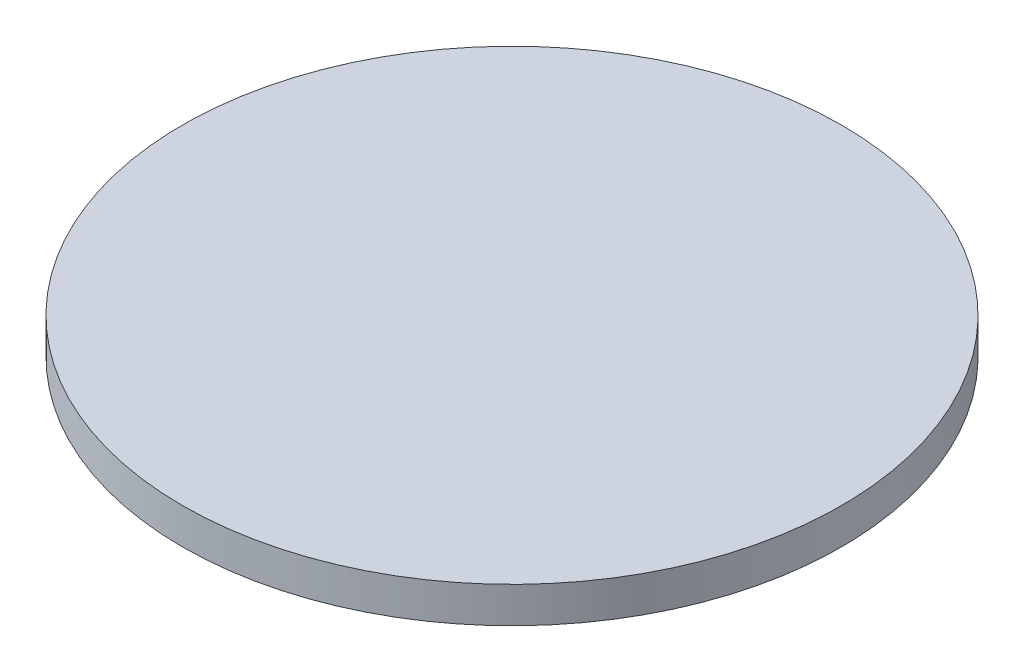
ISO-10303-21;
HEADER;
FILE_DESCRIPTION(('STEP AP214'),'2;1');
FILE_NAME('part.step','',(''),(''),'','','');
FILE_SCHEMA(('AUTOMOTIVE_DESIGN { 1 0 10303 214 1 1 1 1 }'));
ENDSEC;
DATA;
#1=APPLICATION_CONTEXT('core data for automotive mechanical design processes');
#2=APPLICATION_PROTOCOL_DEFINITION('international standard','automotive_design',2000,#1);
#3=PRODUCT_CONTEXT('',#1,'mechanical');
#4=PRODUCT('Part','Part','',(#3));
#5=PRODUCT_RELATED_PRODUCT_CATEGORY('part','',(#4));
#6=PRODUCT_DEFINITION_FORMATION('','',#4);
#7=PRODUCT_DEFINITION_CONTEXT('part definition',#1,'design');
#8=PRODUCT_DEFINITION('design','',#6,#7);
#9=PRODUCT_DEFINITION_SHAPE('','',#8);
#10=(LENGTH_UNIT() NAMED_UNIT(*) SI_UNIT(.MILLI.,.METRE.));
#11=(NAMED_UNIT(*) PLANE_ANGLE_UNIT() SI_UNIT($,.RADIAN.));
#12=(NAMED_UNIT(*) SI_UNIT($,.STERADIAN.) SOLID_ANGLE_UNIT());
#13=UNCERTAINTY_MEASURE_WITH_UNIT(LENGTH_MEASURE(1.E-05),#10,'distance_accuracy_value','');
#14=(GEOMETRIC_REPRESENTATION_CONTEXT(3) GLOBAL_UNCERTAINTY_ASSIGNED_CONTEXT((#13)) GLOBAL_UNIT_ASSIGNED_CONTEXT((#10,
#11,#12)) REPRESENTATION_CONTEXT('',''));
#15=CARTESIAN_POINT('',(0.,0.,0.));
#16=DIRECTION('',(0.,0.,1.));
#17=DIRECTION('',(1.,0.,0.));
#18=AXIS2_PLACEMENT_3D('',#15,#16,#17);
#19=CARTESIAN_POINT('',(0.,1.36,0.));
#20=DIRECTION('',(0.,-1.,0.));
#21=DIRECTION('',(0.,0.,-1.));
#22=AXIS2_PLACEMENT_3D('',#19,#20,#21);
#23=CYLINDRICAL_SURFACE('',#22,12.5);
#24=CARTESIAN_POINT('',(0.,1.36,0.));
#25=DIRECTION('',(0.,1.,0.));
#26=DIRECTION('',(0.,0.,1.));
#27=AXIS2_PLACEMENT_3D('',#24,#25,#26);
#28=CIRCLE('',#27,12.5);
#29=CARTESIAN_POINT('',(0.,1.36,12.5));
#30=VERTEX_POINT('',#29);
#31=EDGE_CURVE('E10',#30,#30,#28,.T.);
#32=ORIENTED_EDGE('',*,*,#31,.F.);
#33=EDGE_LOOP('',(#32));
#34=FACE_BOUND('',#33,.T.);
#35=CARTESIAN_POINT('',(0.,0.,0.));
#36=DIRECTION('',(0.,1.,0.));
#37=DIRECTION('',(0.,0.,1.));
#38=AXIS2_PLACEMENT_3D('',#35,#36,#37);
#39=CIRCLE('',#38,12.5);
#40=CARTESIAN_POINT('',(0.,0.,12.5));
#41=VERTEX_POINT('',#40);
#42=EDGE_CURVE('E36',#41,#41,#39,.T.);
#43=ORIENTED_EDGE('',*,*,#42,.T.);
#44=EDGE_LOOP('',(#43));
#45=FACE_BOUND('',#44,.T.);
#46=ADVANCED_FACE('F33',(#34,#45),#23,.T.);
#47=CARTESIAN_POINT('',(0.,1.36,0.));
#48=DIRECTION('',(0.,1.,0.));
#49=DIRECTION('',(0.,0.,1.));
#50=AXIS2_PLACEMENT_3D('',#47,#48,#49);
#51=PLANE('',#50);
#52=ORIENTED_EDGE('',*,*,#31,.T.);
#53=EDGE_LOOP('',(#52));
#54=FACE_BOUND('',#53,.T.);
#55=ADVANCED_FACE('F48',(#54),#51,.T.);
#56=CARTESIAN_POINT('',(0.,0.,0.));
#57=DIRECTION('',(0.,1.,0.));
#58=DIRECTION('',(0.,0.,1.));
#59=AXIS2_PLACEMENT_3D('',#56,#57,#58);
#60=PLANE('',#59);
#61=ORIENTED_EDGE('',*,*,#42,.F.);
#62=EDGE_LOOP('',(#61));
#63=FACE_BOUND('',#62,.T.);
#64=ADVANCED_FACE('F46',(#63),#60,.F.);
#65=CLOSED_SHELL('',(#46,#55,#64));
#66=MANIFOLD_SOLID_BREP('B2',#65);
#67=ADVANCED_BREP_SHAPE_REPRESENTATION('',(#18,#66),#14);
#68=SHAPE_DEFINITION_REPRESENTATION(#9,#67);
ENDSEC;
END-ISO-10303-21;
